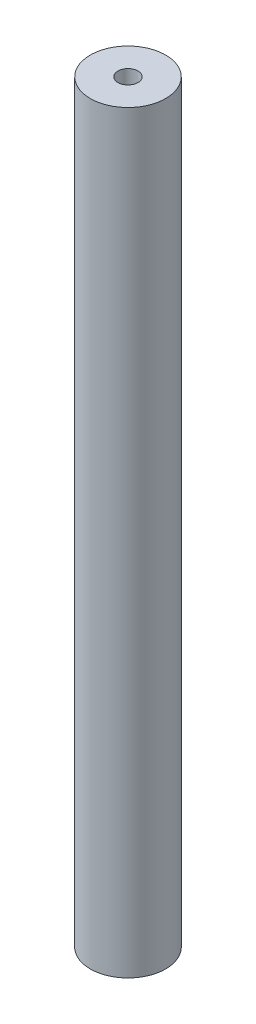
ISO-10303-21;
HEADER;
FILE_DESCRIPTION(('STEP AP214'),'2;1');
FILE_NAME('part.step','',(''),(''),'','','');
FILE_SCHEMA(('AUTOMOTIVE_DESIGN { 1 0 10303 214 1 1 1 1 }'));
ENDSEC;
DATA;
#1=APPLICATION_CONTEXT('core data for automotive mechanical design processes');
#2=APPLICATION_PROTOCOL_DEFINITION('international standard','automotive_design',2000,#1);
#3=PRODUCT_CONTEXT('',#1,'mechanical');
#4=PRODUCT('Part','Part','',(#3));
#5=PRODUCT_RELATED_PRODUCT_CATEGORY('part','',(#4));
#6=PRODUCT_DEFINITION_FORMATION('','',#4);
#7=PRODUCT_DEFINITION_CONTEXT('part definition',#1,'design');
#8=PRODUCT_DEFINITION('design','',#6,#7);
#9=PRODUCT_DEFINITION_SHAPE('','',#8);
#10=(LENGTH_UNIT() NAMED_UNIT(*) SI_UNIT(.MILLI.,.METRE.));
#11=(NAMED_UNIT(*) PLANE_ANGLE_UNIT() SI_UNIT($,.RADIAN.));
#12=(NAMED_UNIT(*) SI_UNIT($,.STERADIAN.) SOLID_ANGLE_UNIT());
#13=UNCERTAINTY_MEASURE_WITH_UNIT(LENGTH_MEASURE(1.E-05),#10,'distance_accuracy_value','');
#14=(GEOMETRIC_REPRESENTATION_CONTEXT(3) GLOBAL_UNCERTAINTY_ASSIGNED_CONTEXT((#13)) GLOBAL_UNIT_ASSIGNED_CONTEXT((#10,
#11,#12)) REPRESENTATION_CONTEXT('',''));
#15=CARTESIAN_POINT('',(0.,0.,0.));
#16=DIRECTION('',(0.,0.,1.));
#17=DIRECTION('',(1.,0.,0.));
#18=AXIS2_PLACEMENT_3D('',#15,#16,#17);
#19=CARTESIAN_POINT('',(0.,300.,0.));
#20=DIRECTION('',(0.,1.,0.));
#21=DIRECTION('',(0.,0.,1.));
#22=AXIS2_PLACEMENT_3D('',#19,#20,#21);
#23=PLANE('',#22);
#24=CARTESIAN_POINT('',(0.,300.,0.));
#25=DIRECTION('',(0.,1.,0.));
#26=DIRECTION('',(0.,0.,1.));
#27=AXIS2_PLACEMENT_3D('',#24,#25,#26);
#28=CIRCLE('',#27,15.);
#29=CARTESIAN_POINT('',(0.,300.,15.));
#30=VERTEX_POINT('',#29);
#31=EDGE_CURVE('E10',#30,#30,#28,.T.);
#32=ORIENTED_EDGE('',*,*,#31,.T.);
#33=EDGE_LOOP('',(#32));
#34=FACE_BOUND('',#33,.T.);
#35=CARTESIAN_POINT('',(0.,300.,0.));
#36=DIRECTION('',(0.,1.,0.));
#37=DIRECTION('',(0.,0.,1.));
#38=AXIS2_PLACEMENT_3D('',#35,#36,#37);
#39=CIRCLE('',#38,4.);
#40=CARTESIAN_POINT('',(0.,300.,4.));
#41=VERTEX_POINT('',#40);
#42=EDGE_CURVE('E56',#41,#41,#39,.T.);
#43=ORIENTED_EDGE('',*,*,#42,.F.);
#44=EDGE_LOOP('',(#43));
#45=FACE_BOUND('',#44,.T.);
#46=ADVANCED_FACE('F43',(#34,#45),#23,.T.);
#47=CARTESIAN_POINT('',(0.,0.,0.));
#48=DIRECTION('',(0.,1.,0.));
#49=DIRECTION('',(0.,0.,1.));
#50=AXIS2_PLACEMENT_3D('',#47,#48,#49);
#51=PLANE('',#50);
#52=CARTESIAN_POINT('',(0.,0.,0.));
#53=DIRECTION('',(0.,1.,0.));
#54=DIRECTION('',(0.,0.,1.));
#55=AXIS2_PLACEMENT_3D('',#52,#53,#54);
#56=CIRCLE('',#55,15.);
#57=CARTESIAN_POINT('',(0.,0.,15.));
#58=VERTEX_POINT('',#57);
#59=EDGE_CURVE('E47',#58,#58,#56,.T.);
#60=ORIENTED_EDGE('',*,*,#59,.F.);
#61=EDGE_LOOP('',(#60));
#62=FACE_BOUND('',#61,.T.);
#63=CARTESIAN_POINT('',(0.,0.,0.));
#64=DIRECTION('',(0.,1.,0.));
#65=DIRECTION('',(0.,0.,1.));
#66=AXIS2_PLACEMENT_3D('',#63,#64,#65);
#67=CIRCLE('',#66,4.);
#68=CARTESIAN_POINT('',(0.,0.,4.));
#69=VERTEX_POINT('',#68);
#70=EDGE_CURVE('E58',#69,#69,#67,.T.);
#71=ORIENTED_EDGE('',*,*,#70,.T.);
#72=EDGE_LOOP('',(#71));
#73=FACE_BOUND('',#72,.T.);
#74=ADVANCED_FACE('F70',(#62,#73),#51,.F.);
#75=CARTESIAN_POINT('',(0.,300.,0.));
#76=DIRECTION('',(0.,-1.,0.));
#77=DIRECTION('',(0.,0.,-1.));
#78=AXIS2_PLACEMENT_3D('',#75,#76,#77);
#79=CYLINDRICAL_SURFACE('',#78,15.);
#80=ORIENTED_EDGE('',*,*,#31,.F.);
#81=EDGE_LOOP('',(#80));
#82=FACE_BOUND('',#81,.T.);
#83=ORIENTED_EDGE('',*,*,#59,.T.);
#84=EDGE_LOOP('',(#83));
#85=FACE_BOUND('',#84,.T.);
#86=ADVANCED_FACE('F45',(#82,#85),#79,.T.);
#87=CARTESIAN_POINT('',(0.,300.,0.));
#88=DIRECTION('',(0.,-1.,0.));
#89=DIRECTION('',(0.,0.,-1.));
#90=AXIS2_PLACEMENT_3D('',#87,#88,#89);
#91=CYLINDRICAL_SURFACE('',#90,4.);
#92=ORIENTED_EDGE('',*,*,#42,.T.);
#93=EDGE_LOOP('',(#92));
#94=FACE_BOUND('',#93,.T.);
#95=ORIENTED_EDGE('',*,*,#70,.F.);
#96=EDGE_LOOP('',(#95));
#97=FACE_BOUND('',#96,.T.);
#98=ADVANCED_FACE('F66',(#94,#97),#91,.F.);
#99=CLOSED_SHELL('',(#46,#74,#86,#98));
#100=MANIFOLD_SOLID_BREP('B2',#99);
#101=ADVANCED_BREP_SHAPE_REPRESENTATION('',(#18,#100),#14);
#102=SHAPE_DEFINITION_REPRESENTATION(#9,#101);
ENDSEC;
END-ISO-10303-21;
